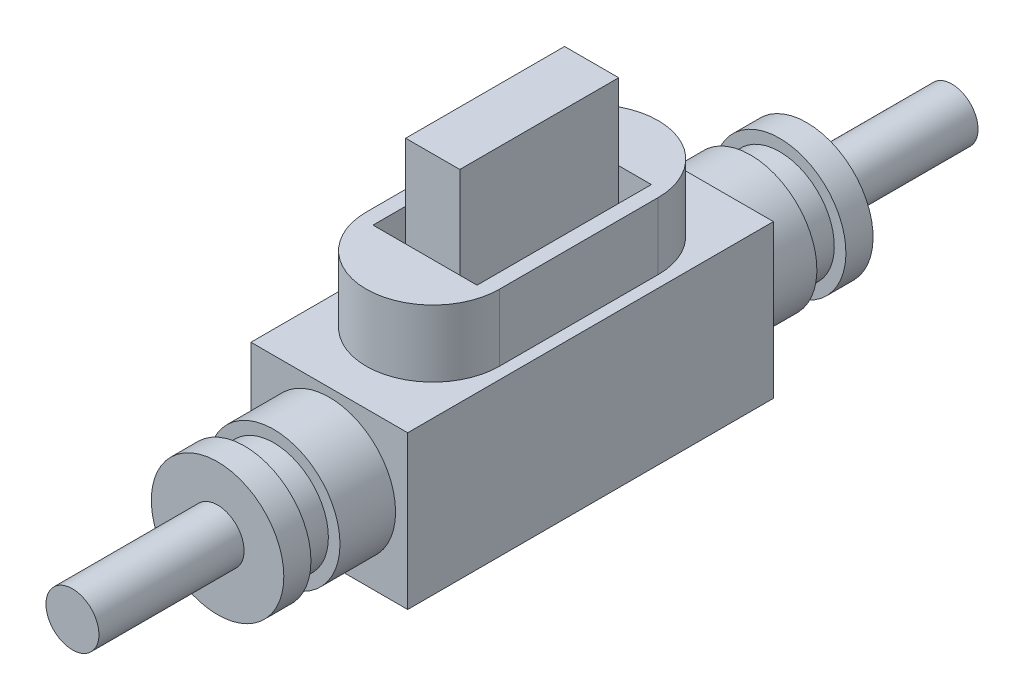
ISO-10303-21;
HEADER;
FILE_DESCRIPTION(('STEP AP214'),'2;1');
FILE_NAME('part.step','',(''),(''),'','','');
FILE_SCHEMA(('AUTOMOTIVE_DESIGN { 1 0 10303 214 1 1 1 1 }'));
ENDSEC;
DATA;
#1=APPLICATION_CONTEXT('core data for automotive mechanical design processes');
#2=APPLICATION_PROTOCOL_DEFINITION('international standard','automotive_design',2000,#1);
#3=PRODUCT_CONTEXT('',#1,'mechanical');
#4=PRODUCT('Part','Part','',(#3));
#5=PRODUCT_RELATED_PRODUCT_CATEGORY('part','',(#4));
#6=PRODUCT_DEFINITION_FORMATION('','',#4);
#7=PRODUCT_DEFINITION_CONTEXT('part definition',#1,'design');
#8=PRODUCT_DEFINITION('design','',#6,#7);
#9=PRODUCT_DEFINITION_SHAPE('','',#8);
#10=(LENGTH_UNIT() NAMED_UNIT(*) SI_UNIT(.MILLI.,.METRE.));
#11=(NAMED_UNIT(*) PLANE_ANGLE_UNIT() SI_UNIT($,.RADIAN.));
#12=(NAMED_UNIT(*) SI_UNIT($,.STERADIAN.) SOLID_ANGLE_UNIT());
#13=UNCERTAINTY_MEASURE_WITH_UNIT(LENGTH_MEASURE(1.E-05),#10,'distance_accuracy_value','');
#14=(GEOMETRIC_REPRESENTATION_CONTEXT(3) GLOBAL_UNCERTAINTY_ASSIGNED_CONTEXT((#13)) GLOBAL_UNIT_ASSIGNED_CONTEXT((#10,
#11,#12)) REPRESENTATION_CONTEXT('',''));
#15=CARTESIAN_POINT('',(0.,0.,0.));
#16=DIRECTION('',(0.,0.,1.));
#17=DIRECTION('',(1.,0.,0.));
#18=AXIS2_PLACEMENT_3D('',#15,#16,#17);
#19=CARTESIAN_POINT('',(0.,11.55,0.));
#20=DIRECTION('',(0.,1.,0.));
#21=DIRECTION('',(0.,0.,1.));
#22=AXIS2_PLACEMENT_3D('',#19,#20,#21);
#23=PLANE('',#22);
#24=DIRECTION('',(0.,0.,1.));
#25=VECTOR('',#24,1.);
#26=CARTESIAN_POINT('',(-3.585,11.55,6.005));
#27=LINE('',#26,#25);
#28=CARTESIAN_POINT('',(-3.585,11.55,-6.005));
#29=VERTEX_POINT('',#28);
#30=CARTESIAN_POINT('',(-3.585,11.55,6.005));
#31=VERTEX_POINT('',#30);
#32=EDGE_CURVE('E197',#29,#31,#27,.T.);
#33=ORIENTED_EDGE('',*,*,#32,.T.);
#34=DIRECTION('',(1.,0.,0.));
#35=VECTOR('',#34,1.);
#36=CARTESIAN_POINT('',(3.585,11.55,6.005));
#37=LINE('',#36,#35);
#38=CARTESIAN_POINT('',(3.585,11.55,6.005));
#39=VERTEX_POINT('',#38);
#40=EDGE_CURVE('E201',#31,#39,#37,.T.);
#41=ORIENTED_EDGE('',*,*,#40,.T.);
#42=DIRECTION('',(0.,0.,-1.));
#43=VECTOR('',#42,1.);
#44=CARTESIAN_POINT('',(3.585,11.55,6.005));
#45=LINE('',#44,#43);
#46=CARTESIAN_POINT('',(3.585,11.55,-6.005));
#47=VERTEX_POINT('',#46);
#48=EDGE_CURVE('E206',#39,#47,#45,.T.);
#49=ORIENTED_EDGE('',*,*,#48,.T.);
#50=DIRECTION('',(-1.,0.,0.));
#51=VECTOR('',#50,1.);
#52=CARTESIAN_POINT('',(3.585,11.55,-6.005));
#53=LINE('',#52,#51);
#54=EDGE_CURVE('E210',#47,#29,#53,.T.);
#55=ORIENTED_EDGE('',*,*,#54,.T.);
#56=EDGE_LOOP('',(#33,#41,#49,#55));
#57=FACE_BOUND('',#56,.T.);
#58=DIRECTION('',(1.,0.,0.));
#59=VECTOR('',#58,1.);
#60=CARTESIAN_POINT('',(1.865,11.55,5.475));
#61=LINE('',#60,#59);
#62=CARTESIAN_POINT('',(-1.865,11.55,5.475));
#63=VERTEX_POINT('',#62);
#64=CARTESIAN_POINT('',(1.865,11.55,5.475));
#65=VERTEX_POINT('',#64);
#66=EDGE_CURVE('E912',#63,#65,#61,.T.);
#67=ORIENTED_EDGE('',*,*,#66,.F.);
#68=DIRECTION('',(0.,0.,1.));
#69=VECTOR('',#68,1.);
#70=CARTESIAN_POINT('',(-1.865,11.55,5.475));
#71=LINE('',#70,#69);
#72=CARTESIAN_POINT('',(-1.865,11.55,-5.475));
#73=VERTEX_POINT('',#72);
#74=EDGE_CURVE('E186',#73,#63,#71,.T.);
#75=ORIENTED_EDGE('',*,*,#74,.F.);
#76=DIRECTION('',(-1.,0.,0.));
#77=VECTOR('',#76,1.);
#78=CARTESIAN_POINT('',(1.865,11.55,-5.475));
#79=LINE('',#78,#77);
#80=CARTESIAN_POINT('',(1.865,11.55,-5.475));
#81=VERTEX_POINT('',#80);
#82=EDGE_CURVE('E182',#81,#73,#79,.T.);
#83=ORIENTED_EDGE('',*,*,#82,.F.);
#84=DIRECTION('',(0.,0.,-1.));
#85=VECTOR('',#84,1.);
#86=CARTESIAN_POINT('',(1.865,11.55,5.475));
#87=LINE('',#86,#85);
#88=EDGE_CURVE('E915',#65,#81,#87,.T.);
#89=ORIENTED_EDGE('',*,*,#88,.F.);
#90=EDGE_LOOP('',(#67,#75,#83,#89));
#91=FACE_BOUND('',#90,.T.);
#92=ADVANCED_FACE('F45',(#57,#91),#23,.T.);
#93=CARTESIAN_POINT('',(0.,5.34443927232867,-20.3));
#94=DIRECTION('',(0.,0.,1.));
#95=DIRECTION('',(1.,0.,0.));
#96=AXIS2_PLACEMENT_3D('',#93,#94,#95);
#97=CYLINDRICAL_SURFACE('',#96,4.565);
#98=CARTESIAN_POINT('',(0.,5.34443927232867,-12.6));
#99=DIRECTION('',(0.,0.,-1.));
#100=DIRECTION('',(-1.,0.,0.));
#101=AXIS2_PLACEMENT_3D('',#98,#99,#100);
#102=CIRCLE('',#101,4.565);
#103=CARTESIAN_POINT('',(-4.565,5.34443927232867,-12.6));
#104=VERTEX_POINT('',#103);
#105=EDGE_CURVE('E318',#104,#104,#102,.T.);
#106=ORIENTED_EDGE('',*,*,#105,.T.);
#107=EDGE_LOOP('',(#106));
#108=FACE_BOUND('',#107,.T.);
#109=CARTESIAN_POINT('',(0.,5.34443927232866,-16.43));
#110=DIRECTION('',(0.,0.,-1.));
#111=DIRECTION('',(0.,1.,0.));
#112=AXIS2_PLACEMENT_3D('',#109,#110,#111);
#113=CIRCLE('',#112,4.565);
#114=CARTESIAN_POINT('',(0.,9.90943927232867,-16.43));
#115=VERTEX_POINT('',#114);
#116=EDGE_CURVE('E293',#115,#115,#113,.T.);
#117=ORIENTED_EDGE('',*,*,#116,.F.);
#118=EDGE_LOOP('',(#117));
#119=FACE_BOUND('',#118,.T.);
#120=ADVANCED_FACE('F401',(#108,#119),#97,.T.);
#121=CARTESIAN_POINT('',(0.,5.40395864861025,20.3));
#122=DIRECTION('',(0.,0.,-1.));
#123=DIRECTION('',(-1.,0.,0.));
#124=AXIS2_PLACEMENT_3D('',#121,#122,#123);
#125=CYLINDRICAL_SURFACE('',#124,4.565);
#126=CARTESIAN_POINT('',(0.,5.40395864861025,12.6));
#127=DIRECTION('',(0.,0.,1.));
#128=DIRECTION('',(1.,0.,0.));
#129=AXIS2_PLACEMENT_3D('',#126,#127,#128);
#130=CIRCLE('',#129,4.565);
#131=CARTESIAN_POINT('',(4.565,5.40395864861025,12.6));
#132=VERTEX_POINT('',#131);
#133=EDGE_CURVE('E322',#132,#132,#130,.T.);
#134=ORIENTED_EDGE('',*,*,#133,.T.);
#135=EDGE_LOOP('',(#134));
#136=FACE_BOUND('',#135,.T.);
#137=CARTESIAN_POINT('',(0.,5.40395864861025,16.43));
#138=DIRECTION('',(0.,0.,1.));
#139=DIRECTION('',(1.,0.,0.));
#140=AXIS2_PLACEMENT_3D('',#137,#138,#139);
#141=CIRCLE('',#140,4.565);
#142=CARTESIAN_POINT('',(4.565,5.40395864861025,16.43));
#143=VERTEX_POINT('',#142);
#144=EDGE_CURVE('E309',#143,#143,#141,.T.);
#145=ORIENTED_EDGE('',*,*,#144,.F.);
#146=EDGE_LOOP('',(#145));
#147=FACE_BOUND('',#146,.T.);
#148=ADVANCED_FACE('F407',(#136,#147),#125,.T.);
#149=CARTESIAN_POINT('',(-5.4,10.55,12.6));
#150=DIRECTION('',(1.,0.,0.));
#151=DIRECTION('',(0.,0.,-1.));
#152=AXIS2_PLACEMENT_3D('',#149,#150,#151);
#153=PLANE('',#152);
#154=DIRECTION('',(0.,0.,1.));
#155=VECTOR('',#154,1.);
#156=CARTESIAN_POINT('',(-5.4,0.,12.6));
#157=LINE('',#156,#155);
#158=CARTESIAN_POINT('',(-5.4,0.,-12.6));
#159=VERTEX_POINT('',#158);
#160=CARTESIAN_POINT('',(-5.4,0.,12.6));
#161=VERTEX_POINT('',#160);
#162=EDGE_CURVE('E326',#159,#161,#157,.T.);
#163=ORIENTED_EDGE('',*,*,#162,.T.);
#164=DIRECTION('',(0.,-1.,0.));
#165=VECTOR('',#164,1.);
#166=CARTESIAN_POINT('',(-5.4,10.55,12.6));
#167=LINE('',#166,#165);
#168=CARTESIAN_POINT('',(-5.4,10.55,12.6));
#169=VERTEX_POINT('',#168);
#170=EDGE_CURVE('E49',#169,#161,#167,.T.);
#171=ORIENTED_EDGE('',*,*,#170,.F.);
#172=DIRECTION('',(0.,0.,1.));
#173=VECTOR('',#172,1.);
#174=CARTESIAN_POINT('',(-5.4,10.55,12.6));
#175=LINE('',#174,#173);
#176=CARTESIAN_POINT('',(-5.4,10.55,-12.6));
#177=VERTEX_POINT('',#176);
#178=EDGE_CURVE('E330',#177,#169,#175,.T.);
#179=ORIENTED_EDGE('',*,*,#178,.F.);
#180=DIRECTION('',(0.,-1.,0.));
#181=VECTOR('',#180,1.);
#182=CARTESIAN_POINT('',(-5.4,10.55,-12.6));
#183=LINE('',#182,#181);
#184=EDGE_CURVE('E344',#177,#159,#183,.T.);
#185=ORIENTED_EDGE('',*,*,#184,.T.);
#186=EDGE_LOOP('',(#163,#171,#179,#185));
#187=FACE_BOUND('',#186,.T.);
#188=ADVANCED_FACE('F47',(#187),#153,.F.);
#189=CARTESIAN_POINT('',(5.4,10.55,12.6));
#190=DIRECTION('',(0.,0.,-1.));
#191=DIRECTION('',(-1.,0.,0.));
#192=AXIS2_PLACEMENT_3D('',#189,#190,#191);
#193=PLANE('',#192);
#194=ORIENTED_EDGE('',*,*,#133,.F.);
#195=EDGE_LOOP('',(#194));
#196=FACE_BOUND('',#195,.T.);
#197=DIRECTION('',(1.,0.,0.));
#198=VECTOR('',#197,1.);
#199=CARTESIAN_POINT('',(5.4,0.,12.6));
#200=LINE('',#199,#198);
#201=CARTESIAN_POINT('',(5.4,0.,12.6));
#202=VERTEX_POINT('',#201);
#203=EDGE_CURVE('E348',#161,#202,#200,.T.);
#204=ORIENTED_EDGE('',*,*,#203,.T.);
#205=DIRECTION('',(0.,-1.,0.));
#206=VECTOR('',#205,1.);
#207=CARTESIAN_POINT('',(5.4,10.55,12.6));
#208=LINE('',#207,#206);
#209=CARTESIAN_POINT('',(5.4,10.55,12.6));
#210=VERTEX_POINT('',#209);
#211=EDGE_CURVE('E362',#210,#202,#208,.T.);
#212=ORIENTED_EDGE('',*,*,#211,.F.);
#213=DIRECTION('',(1.,0.,0.));
#214=VECTOR('',#213,1.);
#215=CARTESIAN_POINT('',(5.4,10.55,12.6));
#216=LINE('',#215,#214);
#217=EDGE_CURVE('E334',#169,#210,#216,.T.);
#218=ORIENTED_EDGE('',*,*,#217,.F.);
#219=ORIENTED_EDGE('',*,*,#170,.T.);
#220=EDGE_LOOP('',(#204,#212,#218,#219));
#221=FACE_BOUND('',#220,.T.);
#222=ADVANCED_FACE('F373',(#196,#221),#193,.F.);
#223=CARTESIAN_POINT('',(5.4,10.55,12.6));
#224=DIRECTION('',(-1.,0.,0.));
#225=DIRECTION('',(0.,0.,1.));
#226=AXIS2_PLACEMENT_3D('',#223,#224,#225);
#227=PLANE('',#226);
#228=DIRECTION('',(0.,0.,-1.));
#229=VECTOR('',#228,1.);
#230=CARTESIAN_POINT('',(5.4,0.,12.6));
#231=LINE('',#230,#229);
#232=CARTESIAN_POINT('',(5.4,0.,-12.6));
#233=VERTEX_POINT('',#232);
#234=EDGE_CURVE('E351',#202,#233,#231,.T.);
#235=ORIENTED_EDGE('',*,*,#234,.T.);
#236=DIRECTION('',(0.,-1.,0.));
#237=VECTOR('',#236,1.);
#238=CARTESIAN_POINT('',(5.4,10.55,-12.6));
#239=LINE('',#238,#237);
#240=CARTESIAN_POINT('',(5.4,10.55,-12.6));
#241=VERTEX_POINT('',#240);
#242=EDGE_CURVE('E359',#241,#233,#239,.T.);
#243=ORIENTED_EDGE('',*,*,#242,.F.);
#244=DIRECTION('',(0.,0.,-1.));
#245=VECTOR('',#244,1.);
#246=CARTESIAN_POINT('',(5.4,10.55,12.6));
#247=LINE('',#246,#245);
#248=EDGE_CURVE('E338',#210,#241,#247,.T.);
#249=ORIENTED_EDGE('',*,*,#248,.F.);
#250=ORIENTED_EDGE('',*,*,#211,.T.);
#251=EDGE_LOOP('',(#235,#243,#249,#250));
#252=FACE_BOUND('',#251,.T.);
#253=ADVANCED_FACE('F382',(#252),#227,.F.);
#254=CARTESIAN_POINT('',(5.4,10.55,-12.6));
#255=DIRECTION('',(0.,0.,1.));
#256=DIRECTION('',(1.,0.,0.));
#257=AXIS2_PLACEMENT_3D('',#254,#255,#256);
#258=PLANE('',#257);
#259=ORIENTED_EDGE('',*,*,#105,.F.);
#260=EDGE_LOOP('',(#259));
#261=FACE_BOUND('',#260,.T.);
#262=DIRECTION('',(-1.,0.,0.));
#263=VECTOR('',#262,1.);
#264=CARTESIAN_POINT('',(5.4,0.,-12.6));
#265=LINE('',#264,#263);
#266=EDGE_CURVE('E335',#233,#159,#265,.T.);
#267=ORIENTED_EDGE('',*,*,#266,.T.);
#268=ORIENTED_EDGE('',*,*,#184,.F.);
#269=DIRECTION('',(-1.,0.,0.));
#270=VECTOR('',#269,1.);
#271=CARTESIAN_POINT('',(5.4,10.55,-12.6));
#272=LINE('',#271,#270);
#273=EDGE_CURVE('E341',#241,#177,#272,.T.);
#274=ORIENTED_EDGE('',*,*,#273,.F.);
#275=ORIENTED_EDGE('',*,*,#242,.T.);
#276=EDGE_LOOP('',(#267,#268,#274,#275));
#277=FACE_BOUND('',#276,.T.);
#278=ADVANCED_FACE('F385',(#261,#277),#258,.F.);
#279=CARTESIAN_POINT('',(0.,10.55,0.));
#280=DIRECTION('',(0.,1.,0.));
#281=DIRECTION('',(0.,0.,1.));
#282=AXIS2_PLACEMENT_3D('',#279,#280,#281);
#283=PLANE('',#282);
#284=CARTESIAN_POINT('',(0.,10.55,-5.465));
#285=DIRECTION('',(0.,1.,0.));
#286=DIRECTION('',(0.,0.,-1.));
#287=AXIS2_PLACEMENT_3D('',#284,#285,#286);
#288=CIRCLE('',#287,4.595);
#289=CARTESIAN_POINT('',(4.595,10.55,-5.465));
#290=VERTEX_POINT('',#289);
#291=CARTESIAN_POINT('',(-4.595,10.55,-5.465));
#292=VERTEX_POINT('',#291);
#293=EDGE_CURVE('E228',#290,#292,#288,.T.);
#294=ORIENTED_EDGE('',*,*,#293,.F.);
#295=DIRECTION('',(0.,0.,-1.));
#296=VECTOR('',#295,1.);
#297=CARTESIAN_POINT('',(4.595,10.55,5.465));
#298=LINE('',#297,#296);
#299=CARTESIAN_POINT('',(4.595,10.55,5.465));
#300=VERTEX_POINT('',#299);
#301=EDGE_CURVE('E242',#300,#290,#298,.T.);
#302=ORIENTED_EDGE('',*,*,#301,.F.);
#303=CARTESIAN_POINT('',(0.,10.55,5.465));
#304=DIRECTION('',(0.,1.,0.));
#305=DIRECTION('',(0.,0.,1.));
#306=AXIS2_PLACEMENT_3D('',#303,#304,#305);
#307=CIRCLE('',#306,4.595);
#308=CARTESIAN_POINT('',(-4.595,10.55,5.465));
#309=VERTEX_POINT('',#308);
#310=EDGE_CURVE('E259',#309,#300,#307,.T.);
#311=ORIENTED_EDGE('',*,*,#310,.F.);
#312=DIRECTION('',(0.,0.,1.));
#313=VECTOR('',#312,1.);
#314=CARTESIAN_POINT('',(-4.595,10.55,5.465));
#315=LINE('',#314,#313);
#316=EDGE_CURVE('E255',#292,#309,#315,.T.);
#317=ORIENTED_EDGE('',*,*,#316,.F.);
#318=EDGE_LOOP('',(#294,#302,#311,#317));
#319=FACE_BOUND('',#318,.T.);
#320=ORIENTED_EDGE('',*,*,#178,.T.);
#321=ORIENTED_EDGE('',*,*,#217,.T.);
#322=ORIENTED_EDGE('',*,*,#248,.T.);
#323=ORIENTED_EDGE('',*,*,#273,.T.);
#324=EDGE_LOOP('',(#320,#321,#322,#323));
#325=FACE_BOUND('',#324,.T.);
#326=ADVANCED_FACE('F387',(#319,#325),#283,.T.);
#327=CARTESIAN_POINT('',(0.,0.,0.));
#328=DIRECTION('',(0.,1.,0.));
#329=DIRECTION('',(0.,0.,1.));
#330=AXIS2_PLACEMENT_3D('',#327,#328,#329);
#331=PLANE('',#330);
#332=ORIENTED_EDGE('',*,*,#162,.F.);
#333=ORIENTED_EDGE('',*,*,#266,.F.);
#334=ORIENTED_EDGE('',*,*,#234,.F.);
#335=ORIENTED_EDGE('',*,*,#203,.F.);
#336=EDGE_LOOP('',(#332,#333,#334,#335));
#337=FACE_BOUND('',#336,.T.);
#338=ADVANCED_FACE('F380',(#337),#331,.F.);
#339=CARTESIAN_POINT('',(0.,0.,16.43));
#340=DIRECTION('',(0.,0.,1.));
#341=DIRECTION('',(1.,0.,0.));
#342=AXIS2_PLACEMENT_3D('',#339,#340,#341);
#343=PLANE('',#342);
#344=ORIENTED_EDGE('',*,*,#144,.T.);
#345=EDGE_LOOP('',(#344));
#346=FACE_BOUND('',#345,.T.);
#347=CARTESIAN_POINT('',(0.,5.40395864861025,16.43));
#348=DIRECTION('',(0.,0.,1.));
#349=DIRECTION('',(1.,0.,0.));
#350=AXIS2_PLACEMENT_3D('',#347,#348,#349);
#351=CIRCLE('',#350,3.765);
#352=CARTESIAN_POINT('',(3.765,5.40395864861025,16.43));
#353=VERTEX_POINT('',#352);
#354=EDGE_CURVE('E297',#353,#353,#351,.T.);
#355=ORIENTED_EDGE('',*,*,#354,.F.);
#356=EDGE_LOOP('',(#355));
#357=FACE_BOUND('',#356,.T.);
#358=ADVANCED_FACE('F395',(#346,#357),#343,.T.);
#359=CARTESIAN_POINT('',(0.,0.,18.43));
#360=DIRECTION('',(0.,0.,-1.));
#361=DIRECTION('',(-1.,0.,0.));
#362=AXIS2_PLACEMENT_3D('',#359,#360,#361);
#363=PLANE('',#362);
#364=CARTESIAN_POINT('',(0.,5.40395864861025,18.43));
#365=DIRECTION('',(0.,0.,1.));
#366=DIRECTION('',(1.,0.,0.));
#367=AXIS2_PLACEMENT_3D('',#364,#365,#366);
#368=CIRCLE('',#367,3.765);
#369=CARTESIAN_POINT('',(3.765,5.40395864861025,18.43));
#370=VERTEX_POINT('',#369);
#371=EDGE_CURVE('E301',#370,#370,#368,.T.);
#372=ORIENTED_EDGE('',*,*,#371,.T.);
#373=EDGE_LOOP('',(#372));
#374=FACE_BOUND('',#373,.T.);
#375=CARTESIAN_POINT('',(0.,5.40395864861025,18.43));
#376=DIRECTION('',(0.,0.,1.));
#377=DIRECTION('',(1.,0.,0.));
#378=AXIS2_PLACEMENT_3D('',#375,#376,#377);
#379=CIRCLE('',#378,4.565);
#380=CARTESIAN_POINT('',(4.565,5.40395864861025,18.43));
#381=VERTEX_POINT('',#380);
#382=EDGE_CURVE('E305',#381,#381,#379,.T.);
#383=ORIENTED_EDGE('',*,*,#382,.F.);
#384=EDGE_LOOP('',(#383));
#385=FACE_BOUND('',#384,.T.);
#386=ADVANCED_FACE('F468',(#374,#385),#363,.T.);
#387=CARTESIAN_POINT('',(0.,5.40395864861025,20.3));
#388=DIRECTION('',(0.,0.,1.));
#389=DIRECTION('',(1.,0.,0.));
#390=AXIS2_PLACEMENT_3D('',#387,#388,#389);
#391=CYLINDRICAL_SURFACE('',#390,3.765);
#392=ORIENTED_EDGE('',*,*,#371,.F.);
#393=EDGE_LOOP('',(#392));
#394=FACE_BOUND('',#393,.T.);
#395=ORIENTED_EDGE('',*,*,#354,.T.);
#396=EDGE_LOOP('',(#395));
#397=FACE_BOUND('',#396,.T.);
#398=ADVANCED_FACE('F464',(#394,#397),#391,.T.);
#399=CARTESIAN_POINT('',(0.,5.40395864861025,20.3));
#400=DIRECTION('',(0.,0.,1.));
#401=DIRECTION('',(1.,0.,0.));
#402=AXIS2_PLACEMENT_3D('',#399,#400,#401);
#403=PLANE('',#402);
#404=CARTESIAN_POINT('',(0.,5.56469358849985,20.3));
#405=DIRECTION('',(0.,0.,1.));
#406=DIRECTION('',(1.,0.,0.));
#407=AXIS2_PLACEMENT_3D('',#404,#405,#406);
#408=CIRCLE('',#407,1.825);
#409=CARTESIAN_POINT('',(1.825,5.56469358849985,20.3));
#410=VERTEX_POINT('',#409);
#411=EDGE_CURVE('E11',#410,#410,#408,.T.);
#412=ORIENTED_EDGE('',*,*,#411,.F.);
#413=EDGE_LOOP('',(#412));
#414=FACE_BOUND('',#413,.T.);
#415=CARTESIAN_POINT('',(0.,5.40395864861025,20.3));
#416=DIRECTION('',(0.,0.,1.));
#417=DIRECTION('',(1.,0.,0.));
#418=AXIS2_PLACEMENT_3D('',#415,#416,#417);
#419=CIRCLE('',#418,4.565);
#420=CARTESIAN_POINT('',(4.565,5.40395864861025,20.3));
#421=VERTEX_POINT('',#420);
#422=EDGE_CURVE('E317',#421,#421,#419,.T.);
#423=ORIENTED_EDGE('',*,*,#422,.T.);
#424=EDGE_LOOP('',(#423));
#425=FACE_BOUND('',#424,.T.);
#426=ADVANCED_FACE('F467',(#414,#425),#403,.T.);
#427=ORIENTED_EDGE('',*,*,#422,.F.);
#428=EDGE_LOOP('',(#427));
#429=FACE_BOUND('',#428,.T.);
#430=ORIENTED_EDGE('',*,*,#382,.T.);
#431=EDGE_LOOP('',(#430));
#432=FACE_BOUND('',#431,.T.);
#433=ADVANCED_FACE('F462',(#429,#432),#125,.T.);
#434=CARTESIAN_POINT('',(0.,0.,-16.43));
#435=DIRECTION('',(0.,0.,-1.));
#436=DIRECTION('',(0.,1.,0.));
#437=AXIS2_PLACEMENT_3D('',#434,#435,#436);
#438=PLANE('',#437);
#439=ORIENTED_EDGE('',*,*,#116,.T.);
#440=EDGE_LOOP('',(#439));
#441=FACE_BOUND('',#440,.T.);
#442=CARTESIAN_POINT('',(0.,5.34443927232866,-16.43));
#443=DIRECTION('',(0.,0.,-1.));
#444=DIRECTION('',(0.,1.,0.));
#445=AXIS2_PLACEMENT_3D('',#442,#443,#444);
#446=CIRCLE('',#445,3.765);
#447=CARTESIAN_POINT('',(0.,9.10943927232866,-16.43));
#448=VERTEX_POINT('',#447);
#449=EDGE_CURVE('E289',#448,#448,#446,.T.);
#450=ORIENTED_EDGE('',*,*,#449,.F.);
#451=EDGE_LOOP('',(#450));
#452=FACE_BOUND('',#451,.T.);
#453=ADVANCED_FACE('F458',(#441,#452),#438,.T.);
#454=CARTESIAN_POINT('',(0.,5.34443927232867,-20.3));
#455=DIRECTION('',(0.,0.,-1.));
#456=DIRECTION('',(0.,1.,0.));
#457=AXIS2_PLACEMENT_3D('',#454,#455,#456);
#458=CYLINDRICAL_SURFACE('',#457,3.765);
#459=ORIENTED_EDGE('',*,*,#449,.T.);
#460=EDGE_LOOP('',(#459));
#461=FACE_BOUND('',#460,.T.);
#462=CARTESIAN_POINT('',(0.,5.34443927232867,-18.43));
#463=DIRECTION('',(0.,0.,-1.));
#464=DIRECTION('',(0.,1.,0.));
#465=AXIS2_PLACEMENT_3D('',#462,#463,#464);
#466=CIRCLE('',#465,3.765);
#467=CARTESIAN_POINT('',(0.,9.10943927232866,-18.43));
#468=VERTEX_POINT('',#467);
#469=EDGE_CURVE('E285',#468,#468,#466,.T.);
#470=ORIENTED_EDGE('',*,*,#469,.F.);
#471=EDGE_LOOP('',(#470));
#472=FACE_BOUND('',#471,.T.);
#473=ADVANCED_FACE('F454',(#461,#472),#458,.T.);
#474=CARTESIAN_POINT('',(0.,0.,-18.43));
#475=DIRECTION('',(0.,0.,1.));
#476=DIRECTION('',(0.,-1.,0.));
#477=AXIS2_PLACEMENT_3D('',#474,#475,#476);
#478=PLANE('',#477);
#479=ORIENTED_EDGE('',*,*,#469,.T.);
#480=EDGE_LOOP('',(#479));
#481=FACE_BOUND('',#480,.T.);
#482=CARTESIAN_POINT('',(0.,5.34443927232867,-18.43));
#483=DIRECTION('',(0.,0.,-1.));
#484=DIRECTION('',(0.,1.,0.));
#485=AXIS2_PLACEMENT_3D('',#482,#483,#484);
#486=CIRCLE('',#485,4.565);
#487=CARTESIAN_POINT('',(0.,9.90943927232867,-18.43));
#488=VERTEX_POINT('',#487);
#489=EDGE_CURVE('E281',#488,#488,#486,.T.);
#490=ORIENTED_EDGE('',*,*,#489,.F.);
#491=EDGE_LOOP('',(#490));
#492=FACE_BOUND('',#491,.T.);
#493=ADVANCED_FACE('F450',(#481,#492),#478,.T.);
#494=CARTESIAN_POINT('',(0.,5.34443927232867,-20.3));
#495=DIRECTION('',(0.,0.,-1.));
#496=DIRECTION('',(-1.,0.,0.));
#497=AXIS2_PLACEMENT_3D('',#494,#495,#496);
#498=PLANE('',#497);
#499=CARTESIAN_POINT('',(0.,5.40725402507812,-20.3));
#500=DIRECTION('',(0.,0.,-1.));
#501=DIRECTION('',(-1.,0.,0.));
#502=AXIS2_PLACEMENT_3D('',#499,#500,#501);
#503=CIRCLE('',#502,1.8);
#504=CARTESIAN_POINT('',(-1.8,5.40725402507812,-20.3));
#505=VERTEX_POINT('',#504);
#506=EDGE_CURVE('E55',#505,#505,#503,.T.);
#507=ORIENTED_EDGE('',*,*,#506,.F.);
#508=EDGE_LOOP('',(#507));
#509=FACE_BOUND('',#508,.T.);
#510=CARTESIAN_POINT('',(0.,5.34443927232867,-20.3));
#511=DIRECTION('',(0.,0.,-1.));
#512=DIRECTION('',(-1.,0.,0.));
#513=AXIS2_PLACEMENT_3D('',#510,#511,#512);
#514=CIRCLE('',#513,4.565);
#515=CARTESIAN_POINT('',(-4.565,5.34443927232867,-20.3));
#516=VERTEX_POINT('',#515);
#517=EDGE_CURVE('E313',#516,#516,#514,.T.);
#518=ORIENTED_EDGE('',*,*,#517,.T.);
#519=EDGE_LOOP('',(#518));
#520=FACE_BOUND('',#519,.T.);
#521=ADVANCED_FACE('F453',(#509,#520),#498,.T.);
#522=ORIENTED_EDGE('',*,*,#517,.F.);
#523=EDGE_LOOP('',(#522));
#524=FACE_BOUND('',#523,.T.);
#525=ORIENTED_EDGE('',*,*,#489,.T.);
#526=EDGE_LOOP('',(#525));
#527=FACE_BOUND('',#526,.T.);
#528=ADVANCED_FACE('F410',(#524,#527),#97,.T.);
#529=CARTESIAN_POINT('',(0.,15.15,-5.465));
#530=DIRECTION('',(0.,-1.,0.));
#531=DIRECTION('',(0.,0.,-1.));
#532=AXIS2_PLACEMENT_3D('',#529,#530,#531);
#533=CYLINDRICAL_SURFACE('',#532,4.595);
#534=ORIENTED_EDGE('',*,*,#293,.T.);
#535=DIRECTION('',(0.,-1.,0.));
#536=VECTOR('',#535,1.);
#537=CARTESIAN_POINT('',(-4.595,15.15,-5.465));
#538=LINE('',#537,#536);
#539=CARTESIAN_POINT('',(-4.595,15.15,-5.465));
#540=VERTEX_POINT('',#539);
#541=EDGE_CURVE('E277',#540,#292,#538,.T.);
#542=ORIENTED_EDGE('',*,*,#541,.F.);
#543=CARTESIAN_POINT('',(0.,15.15,-5.465));
#544=DIRECTION('',(0.,1.,0.));
#545=DIRECTION('',(0.,0.,-1.));
#546=AXIS2_PLACEMENT_3D('',#543,#544,#545);
#547=CIRCLE('',#546,4.595);
#548=CARTESIAN_POINT('',(4.595,15.15,-5.465));
#549=VERTEX_POINT('',#548);
#550=EDGE_CURVE('E237',#549,#540,#547,.T.);
#551=ORIENTED_EDGE('',*,*,#550,.F.);
#552=DIRECTION('',(0.,-1.,0.));
#553=VECTOR('',#552,1.);
#554=CARTESIAN_POINT('',(4.595,15.15,-5.465));
#555=LINE('',#554,#553);
#556=EDGE_CURVE('E251',#549,#290,#555,.T.);
#557=ORIENTED_EDGE('',*,*,#556,.T.);
#558=EDGE_LOOP('',(#534,#542,#551,#557));
#559=FACE_BOUND('',#558,.T.);
#560=ADVANCED_FACE('F445',(#559),#533,.T.);
#561=CARTESIAN_POINT('',(-4.595,15.15,5.465));
#562=DIRECTION('',(1.,0.,0.));
#563=DIRECTION('',(0.,0.,-1.));
#564=AXIS2_PLACEMENT_3D('',#561,#562,#563);
#565=PLANE('',#564);
#566=ORIENTED_EDGE('',*,*,#316,.T.);
#567=DIRECTION('',(0.,-1.,0.));
#568=VECTOR('',#567,1.);
#569=CARTESIAN_POINT('',(-4.595,15.15,5.465));
#570=LINE('',#569,#568);
#571=CARTESIAN_POINT('',(-4.595,15.15,5.465));
#572=VERTEX_POINT('',#571);
#573=EDGE_CURVE('E273',#572,#309,#570,.T.);
#574=ORIENTED_EDGE('',*,*,#573,.F.);
#575=DIRECTION('',(0.,0.,1.));
#576=VECTOR('',#575,1.);
#577=CARTESIAN_POINT('',(-4.595,15.15,5.465));
#578=LINE('',#577,#576);
#579=EDGE_CURVE('E241',#540,#572,#578,.T.);
#580=ORIENTED_EDGE('',*,*,#579,.F.);
#581=ORIENTED_EDGE('',*,*,#541,.T.);
#582=EDGE_LOOP('',(#566,#574,#580,#581));
#583=FACE_BOUND('',#582,.T.);
#584=ADVANCED_FACE('F441',(#583),#565,.F.);
#585=CARTESIAN_POINT('',(0.,15.15,5.465));
#586=DIRECTION('',(0.,-1.,0.));
#587=DIRECTION('',(0.,0.,-1.));
#588=AXIS2_PLACEMENT_3D('',#585,#586,#587);
#589=CYLINDRICAL_SURFACE('',#588,4.595);
#590=ORIENTED_EDGE('',*,*,#310,.T.);
#591=DIRECTION('',(0.,-1.,0.));
#592=VECTOR('',#591,1.);
#593=CARTESIAN_POINT('',(4.595,15.15,5.465));
#594=LINE('',#593,#592);
#595=CARTESIAN_POINT('',(4.595,15.15,5.465));
#596=VERTEX_POINT('',#595);
#597=EDGE_CURVE('E269',#596,#300,#594,.T.);
#598=ORIENTED_EDGE('',*,*,#597,.F.);
#599=CARTESIAN_POINT('',(0.,15.15,5.465));
#600=DIRECTION('',(0.,1.,0.));
#601=DIRECTION('',(0.,0.,1.));
#602=AXIS2_PLACEMENT_3D('',#599,#600,#601);
#603=CIRCLE('',#602,4.595);
#604=EDGE_CURVE('E245',#572,#596,#603,.T.);
#605=ORIENTED_EDGE('',*,*,#604,.F.);
#606=ORIENTED_EDGE('',*,*,#573,.T.);
#607=EDGE_LOOP('',(#590,#598,#605,#606));
#608=FACE_BOUND('',#607,.T.);
#609=ADVANCED_FACE('F437',(#608),#589,.T.);
#610=CARTESIAN_POINT('',(4.595,15.15,5.465));
#611=DIRECTION('',(-1.,0.,0.));
#612=DIRECTION('',(0.,0.,1.));
#613=AXIS2_PLACEMENT_3D('',#610,#611,#612);
#614=PLANE('',#613);
#615=ORIENTED_EDGE('',*,*,#301,.T.);
#616=ORIENTED_EDGE('',*,*,#556,.F.);
#617=DIRECTION('',(0.,0.,-1.));
#618=VECTOR('',#617,1.);
#619=CARTESIAN_POINT('',(4.595,15.15,5.465));
#620=LINE('',#619,#618);
#621=EDGE_CURVE('E248',#596,#549,#620,.T.);
#622=ORIENTED_EDGE('',*,*,#621,.F.);
#623=ORIENTED_EDGE('',*,*,#597,.T.);
#624=EDGE_LOOP('',(#615,#616,#622,#623));
#625=FACE_BOUND('',#624,.T.);
#626=ADVANCED_FACE('F433',(#625),#614,.F.);
#627=CARTESIAN_POINT('',(0.,15.15,-5.465));
#628=DIRECTION('',(0.,-1.,0.));
#629=DIRECTION('',(0.,0.,-1.));
#630=AXIS2_PLACEMENT_3D('',#627,#628,#629);
#631=PLANE('',#630);
#632=DIRECTION('',(1.,0.,0.));
#633=VECTOR('',#632,1.);
#634=CARTESIAN_POINT('',(3.585,15.15,6.005));
#635=LINE('',#634,#633);
#636=CARTESIAN_POINT('',(-3.585,15.15,6.005));
#637=VERTEX_POINT('',#636);
#638=CARTESIAN_POINT('',(3.585,15.15,6.005));
#639=VERTEX_POINT('',#638);
#640=EDGE_CURVE('E192',#637,#639,#635,.T.);
#641=ORIENTED_EDGE('',*,*,#640,.F.);
#642=DIRECTION('',(0.,0.,1.));
#643=VECTOR('',#642,1.);
#644=CARTESIAN_POINT('',(-3.585,15.15,6.005));
#645=LINE('',#644,#643);
#646=CARTESIAN_POINT('',(-3.585,15.15,-6.005));
#647=VERTEX_POINT('',#646);
#648=EDGE_CURVE('E71',#647,#637,#645,.T.);
#649=ORIENTED_EDGE('',*,*,#648,.F.);
#650=DIRECTION('',(-1.,0.,0.));
#651=VECTOR('',#650,1.);
#652=CARTESIAN_POINT('',(3.585,15.15,-6.005));
#653=LINE('',#652,#651);
#654=CARTESIAN_POINT('',(3.585,15.15,-6.005));
#655=VERTEX_POINT('',#654);
#656=EDGE_CURVE('E202',#655,#647,#653,.T.);
#657=ORIENTED_EDGE('',*,*,#656,.F.);
#658=DIRECTION('',(0.,0.,-1.));
#659=VECTOR('',#658,1.);
#660=CARTESIAN_POINT('',(3.585,15.15,6.005));
#661=LINE('',#660,#659);
#662=EDGE_CURVE('E218',#639,#655,#661,.T.);
#663=ORIENTED_EDGE('',*,*,#662,.F.);
#664=EDGE_LOOP('',(#641,#649,#657,#663));
#665=FACE_BOUND('',#664,.T.);
#666=ORIENTED_EDGE('',*,*,#550,.T.);
#667=ORIENTED_EDGE('',*,*,#579,.T.);
#668=ORIENTED_EDGE('',*,*,#604,.T.);
#669=ORIENTED_EDGE('',*,*,#621,.T.);
#670=EDGE_LOOP('',(#666,#667,#668,#669));
#671=FACE_BOUND('',#670,.T.);
#672=ADVANCED_FACE('F430',(#665,#671),#631,.F.);
#673=CARTESIAN_POINT('',(-3.585,11.55,6.005));
#674=DIRECTION('',(-1.,0.,0.));
#675=DIRECTION('',(0.,0.,1.));
#676=AXIS2_PLACEMENT_3D('',#673,#674,#675);
#677=PLANE('',#676);
#678=ORIENTED_EDGE('',*,*,#648,.T.);
#679=DIRECTION('',(0.,1.,0.));
#680=VECTOR('',#679,1.);
#681=CARTESIAN_POINT('',(-3.585,11.55,6.005));
#682=LINE('',#681,#680);
#683=EDGE_CURVE('E213',#31,#637,#682,.T.);
#684=ORIENTED_EDGE('',*,*,#683,.F.);
#685=ORIENTED_EDGE('',*,*,#32,.F.);
#686=DIRECTION('',(0.,1.,0.));
#687=VECTOR('',#686,1.);
#688=CARTESIAN_POINT('',(-3.585,11.55,-6.005));
#689=LINE('',#688,#687);
#690=EDGE_CURVE('E225',#29,#647,#689,.T.);
#691=ORIENTED_EDGE('',*,*,#690,.T.);
#692=EDGE_LOOP('',(#678,#684,#685,#691));
#693=FACE_BOUND('',#692,.T.);
#694=ADVANCED_FACE('F419',(#693),#677,.F.);
#695=CARTESIAN_POINT('',(3.585,11.55,-6.005));
#696=DIRECTION('',(0.,0.,-1.));
#697=DIRECTION('',(-1.,0.,0.));
#698=AXIS2_PLACEMENT_3D('',#695,#696,#697);
#699=PLANE('',#698);
#700=ORIENTED_EDGE('',*,*,#656,.T.);
#701=ORIENTED_EDGE('',*,*,#690,.F.);
#702=ORIENTED_EDGE('',*,*,#54,.F.);
#703=DIRECTION('',(0.,1.,0.));
#704=VECTOR('',#703,1.);
#705=CARTESIAN_POINT('',(3.585,11.55,-6.005));
#706=LINE('',#705,#704);
#707=EDGE_CURVE('E229',#47,#655,#706,.T.);
#708=ORIENTED_EDGE('',*,*,#707,.T.);
#709=EDGE_LOOP('',(#700,#701,#702,#708));
#710=FACE_BOUND('',#709,.T.);
#711=ADVANCED_FACE('F415',(#710),#699,.F.);
#712=CARTESIAN_POINT('',(3.585,11.55,6.005));
#713=DIRECTION('',(1.,0.,0.));
#714=DIRECTION('',(0.,0.,-1.));
#715=AXIS2_PLACEMENT_3D('',#712,#713,#714);
#716=PLANE('',#715);
#717=ORIENTED_EDGE('',*,*,#662,.T.);
#718=ORIENTED_EDGE('',*,*,#707,.F.);
#719=ORIENTED_EDGE('',*,*,#48,.F.);
#720=DIRECTION('',(0.,1.,0.));
#721=VECTOR('',#720,1.);
#722=CARTESIAN_POINT('',(3.585,11.55,6.005));
#723=LINE('',#722,#721);
#724=EDGE_CURVE('E232',#39,#639,#723,.T.);
#725=ORIENTED_EDGE('',*,*,#724,.T.);
#726=EDGE_LOOP('',(#717,#718,#719,#725));
#727=FACE_BOUND('',#726,.T.);
#728=ADVANCED_FACE('F418',(#727),#716,.F.);
#729=CARTESIAN_POINT('',(3.585,11.55,6.005));
#730=DIRECTION('',(0.,0.,1.));
#731=DIRECTION('',(1.,0.,0.));
#732=AXIS2_PLACEMENT_3D('',#729,#730,#731);
#733=PLANE('',#732);
#734=ORIENTED_EDGE('',*,*,#640,.T.);
#735=ORIENTED_EDGE('',*,*,#724,.F.);
#736=ORIENTED_EDGE('',*,*,#40,.F.);
#737=ORIENTED_EDGE('',*,*,#683,.T.);
#738=EDGE_LOOP('',(#734,#735,#736,#737));
#739=FACE_BOUND('',#738,.T.);
#740=ADVANCED_FACE('F423',(#739),#733,.F.);
#741=CARTESIAN_POINT('',(-1.865,20.93,5.475));
#742=DIRECTION('',(1.,0.,0.));
#743=DIRECTION('',(0.,0.,-1.));
#744=AXIS2_PLACEMENT_3D('',#741,#742,#743);
#745=PLANE('',#744);
#746=ORIENTED_EDGE('',*,*,#74,.T.);
#747=DIRECTION('',(0.,-1.,0.));
#748=VECTOR('',#747,1.);
#749=CARTESIAN_POINT('',(-1.865,20.93,5.475));
#750=LINE('',#749,#748);
#751=CARTESIAN_POINT('',(-1.865,20.93,5.475));
#752=VERTEX_POINT('',#751);
#753=EDGE_CURVE('E165',#752,#63,#750,.T.);
#754=ORIENTED_EDGE('',*,*,#753,.F.);
#755=DIRECTION('',(0.,0.,1.));
#756=VECTOR('',#755,1.);
#757=CARTESIAN_POINT('',(-1.865,20.93,5.475));
#758=LINE('',#757,#756);
#759=CARTESIAN_POINT('',(-1.865,20.93,-5.475));
#760=VERTEX_POINT('',#759);
#761=EDGE_CURVE('E173',#760,#752,#758,.T.);
#762=ORIENTED_EDGE('',*,*,#761,.F.);
#763=DIRECTION('',(0.,-1.,0.));
#764=VECTOR('',#763,1.);
#765=CARTESIAN_POINT('',(-1.865,20.93,-5.475));
#766=LINE('',#765,#764);
#767=EDGE_CURVE('E909',#760,#73,#766,.T.);
#768=ORIENTED_EDGE('',*,*,#767,.T.);
#769=EDGE_LOOP('',(#746,#754,#762,#768));
#770=FACE_BOUND('',#769,.T.);
#771=ADVANCED_FACE('F184',(#770),#745,.F.);
#772=CARTESIAN_POINT('',(1.865,20.93,5.475));
#773=DIRECTION('',(0.,0.,-1.));
#774=DIRECTION('',(-1.,0.,0.));
#775=AXIS2_PLACEMENT_3D('',#772,#773,#774);
#776=PLANE('',#775);
#777=ORIENTED_EDGE('',*,*,#66,.T.);
#778=DIRECTION('',(0.,-1.,0.));
#779=VECTOR('',#778,1.);
#780=CARTESIAN_POINT('',(1.865,20.93,5.475));
#781=LINE('',#780,#779);
#782=CARTESIAN_POINT('',(1.865,20.93,5.475));
#783=VERTEX_POINT('',#782);
#784=EDGE_CURVE('E168',#783,#65,#781,.T.);
#785=ORIENTED_EDGE('',*,*,#784,.F.);
#786=DIRECTION('',(1.,0.,0.));
#787=VECTOR('',#786,1.);
#788=CARTESIAN_POINT('',(1.865,20.93,5.475));
#789=LINE('',#788,#787);
#790=EDGE_CURVE('E161',#752,#783,#789,.T.);
#791=ORIENTED_EDGE('',*,*,#790,.F.);
#792=ORIENTED_EDGE('',*,*,#753,.T.);
#793=EDGE_LOOP('',(#777,#785,#791,#792));
#794=FACE_BOUND('',#793,.T.);
#795=ADVANCED_FACE('F163',(#794),#776,.F.);
#796=CARTESIAN_POINT('',(1.865,20.93,5.475));
#797=DIRECTION('',(-1.,0.,0.));
#798=DIRECTION('',(0.,0.,1.));
#799=AXIS2_PLACEMENT_3D('',#796,#797,#798);
#800=PLANE('',#799);
#801=ORIENTED_EDGE('',*,*,#88,.T.);
#802=DIRECTION('',(0.,-1.,0.));
#803=VECTOR('',#802,1.);
#804=CARTESIAN_POINT('',(1.865,20.93,-5.475));
#805=LINE('',#804,#803);
#806=CARTESIAN_POINT('',(1.865,20.93,-5.475));
#807=VERTEX_POINT('',#806);
#808=EDGE_CURVE('E63',#807,#81,#805,.T.);
#809=ORIENTED_EDGE('',*,*,#808,.F.);
#810=DIRECTION('',(0.,0.,-1.));
#811=VECTOR('',#810,1.);
#812=CARTESIAN_POINT('',(1.865,20.93,5.475));
#813=LINE('',#812,#811);
#814=EDGE_CURVE('E172',#783,#807,#813,.T.);
#815=ORIENTED_EDGE('',*,*,#814,.F.);
#816=ORIENTED_EDGE('',*,*,#784,.T.);
#817=EDGE_LOOP('',(#801,#809,#815,#816));
#818=FACE_BOUND('',#817,.T.);
#819=ADVANCED_FACE('F576',(#818),#800,.F.);
#820=CARTESIAN_POINT('',(1.865,20.93,-5.475));
#821=DIRECTION('',(0.,0.,1.));
#822=DIRECTION('',(1.,0.,0.));
#823=AXIS2_PLACEMENT_3D('',#820,#821,#822);
#824=PLANE('',#823);
#825=ORIENTED_EDGE('',*,*,#82,.T.);
#826=ORIENTED_EDGE('',*,*,#767,.F.);
#827=DIRECTION('',(-1.,0.,0.));
#828=VECTOR('',#827,1.);
#829=CARTESIAN_POINT('',(1.865,20.93,-5.475));
#830=LINE('',#829,#828);
#831=EDGE_CURVE('E177',#807,#760,#830,.T.);
#832=ORIENTED_EDGE('',*,*,#831,.F.);
#833=ORIENTED_EDGE('',*,*,#808,.T.);
#834=EDGE_LOOP('',(#825,#826,#832,#833));
#835=FACE_BOUND('',#834,.T.);
#836=ADVANCED_FACE('F582',(#835),#824,.F.);
#837=CARTESIAN_POINT('',(0.,20.93,0.));
#838=DIRECTION('',(0.,1.,0.));
#839=DIRECTION('',(0.,0.,1.));
#840=AXIS2_PLACEMENT_3D('',#837,#838,#839);
#841=PLANE('',#840);
#842=ORIENTED_EDGE('',*,*,#761,.T.);
#843=ORIENTED_EDGE('',*,*,#790,.T.);
#844=ORIENTED_EDGE('',*,*,#814,.T.);
#845=ORIENTED_EDGE('',*,*,#831,.T.);
#846=EDGE_LOOP('',(#842,#843,#844,#845));
#847=FACE_BOUND('',#846,.T.);
#848=ADVANCED_FACE('F176',(#847),#841,.T.);
#849=CARTESIAN_POINT('',(0.,5.40725402507812,-30.3));
#850=DIRECTION('',(0.,0.,1.));
#851=DIRECTION('',(1.,0.,0.));
#852=AXIS2_PLACEMENT_3D('',#849,#850,#851);
#853=CYLINDRICAL_SURFACE('',#852,1.8);
#854=CARTESIAN_POINT('',(0.,5.40725402507812,-30.3));
#855=DIRECTION('',(0.,0.,-1.));
#856=DIRECTION('',(-1.,0.,0.));
#857=AXIS2_PLACEMENT_3D('',#854,#855,#856);
#858=CIRCLE('',#857,1.8);
#859=CARTESIAN_POINT('',(-1.8,5.40725402507812,-30.3));
#860=VERTEX_POINT('',#859);
#861=EDGE_CURVE('E896',#860,#860,#858,.T.);
#862=ORIENTED_EDGE('',*,*,#861,.F.);
#863=EDGE_LOOP('',(#862));
#864=FACE_BOUND('',#863,.T.);
#865=ORIENTED_EDGE('',*,*,#506,.T.);
#866=EDGE_LOOP('',(#865));
#867=FACE_BOUND('',#866,.T.);
#868=ADVANCED_FACE('F594',(#864,#867),#853,.T.);
#869=CARTESIAN_POINT('',(0.,5.40725402507812,-30.3));
#870=DIRECTION('',(0.,0.,-1.));
#871=DIRECTION('',(-1.,0.,0.));
#872=AXIS2_PLACEMENT_3D('',#869,#870,#871);
#873=PLANE('',#872);
#874=ORIENTED_EDGE('',*,*,#861,.T.);
#875=EDGE_LOOP('',(#874));
#876=FACE_BOUND('',#875,.T.);
#877=ADVANCED_FACE('F600',(#876),#873,.T.);
#878=CARTESIAN_POINT('',(0.,5.56469358849985,30.3));
#879=DIRECTION('',(0.,0.,-1.));
#880=DIRECTION('',(-1.,0.,0.));
#881=AXIS2_PLACEMENT_3D('',#878,#879,#880);
#882=CYLINDRICAL_SURFACE('',#881,1.825);
#883=CARTESIAN_POINT('',(0.,5.56469358849985,30.3));
#884=DIRECTION('',(0.,0.,1.));
#885=DIRECTION('',(1.,0.,0.));
#886=AXIS2_PLACEMENT_3D('',#883,#884,#885);
#887=CIRCLE('',#886,1.825);
#888=CARTESIAN_POINT('',(1.825,5.56469358849985,30.3));
#889=VERTEX_POINT('',#888);
#890=EDGE_CURVE('E894',#889,#889,#887,.T.);
#891=ORIENTED_EDGE('',*,*,#890,.F.);
#892=EDGE_LOOP('',(#891));
#893=FACE_BOUND('',#892,.T.);
#894=ORIENTED_EDGE('',*,*,#411,.T.);
#895=EDGE_LOOP('',(#894));
#896=FACE_BOUND('',#895,.T.);
#897=ADVANCED_FACE('F607',(#893,#896),#882,.T.);
#898=CARTESIAN_POINT('',(0.,5.56469358849985,30.3));
#899=DIRECTION('',(0.,0.,1.));
#900=DIRECTION('',(1.,0.,0.));
#901=AXIS2_PLACEMENT_3D('',#898,#899,#900);
#902=PLANE('',#901);
#903=ORIENTED_EDGE('',*,*,#890,.T.);
#904=EDGE_LOOP('',(#903));
#905=FACE_BOUND('',#904,.T.);
#906=ADVANCED_FACE('F615',(#905),#902,.T.);
#907=CLOSED_SHELL('',(#92,#120,#148,#188,#222,#253,#278,#326,#338,#358,#386,#398,#426,#433,#453,
#473,#493,#521,#528,#560,#584,#609,#626,#672,#694,#711,#728,#740,#771,#795,#819,#836,#848,#868,
#877,#897,#906));
#908=MANIFOLD_SOLID_BREP('B2',#907);
#909=ADVANCED_BREP_SHAPE_REPRESENTATION('',(#18,#908),#14);
#910=SHAPE_DEFINITION_REPRESENTATION(#9,#909);
ENDSEC;
END-ISO-10303-21;
